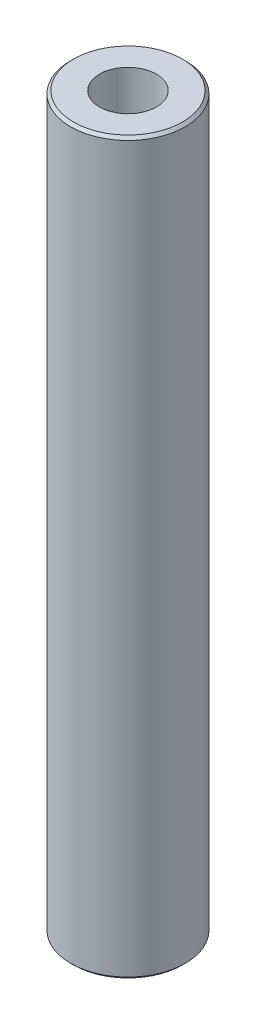
ISO-10303-21;
HEADER;
FILE_DESCRIPTION(('STEP AP214'),'2;1');
FILE_NAME('part.step','',(''),(''),'','','');
FILE_SCHEMA(('AUTOMOTIVE_DESIGN { 1 0 10303 214 1 1 1 1 }'));
ENDSEC;
DATA;
#1=APPLICATION_CONTEXT('core data for automotive mechanical design processes');
#2=APPLICATION_PROTOCOL_DEFINITION('international standard','automotive_design',2000,#1);
#3=PRODUCT_CONTEXT('',#1,'mechanical');
#4=PRODUCT('Part','Part','',(#3));
#5=PRODUCT_RELATED_PRODUCT_CATEGORY('part','',(#4));
#6=PRODUCT_DEFINITION_FORMATION('','',#4);
#7=PRODUCT_DEFINITION_CONTEXT('part definition',#1,'design');
#8=PRODUCT_DEFINITION('design','',#6,#7);
#9=PRODUCT_DEFINITION_SHAPE('','',#8);
#10=(LENGTH_UNIT() NAMED_UNIT(*) SI_UNIT(.MILLI.,.METRE.));
#11=(NAMED_UNIT(*) PLANE_ANGLE_UNIT() SI_UNIT($,.RADIAN.));
#12=(NAMED_UNIT(*) SI_UNIT($,.STERADIAN.) SOLID_ANGLE_UNIT());
#13=UNCERTAINTY_MEASURE_WITH_UNIT(LENGTH_MEASURE(1.E-05),#10,'distance_accuracy_value','');
#14=(GEOMETRIC_REPRESENTATION_CONTEXT(3) GLOBAL_UNCERTAINTY_ASSIGNED_CONTEXT((#13)) GLOBAL_UNIT_ASSIGNED_CONTEXT((#10,
#11,#12)) REPRESENTATION_CONTEXT('',''));
#15=CARTESIAN_POINT('',(0.,0.,0.));
#16=DIRECTION('',(0.,0.,1.));
#17=DIRECTION('',(1.,0.,0.));
#18=AXIS2_PLACEMENT_3D('',#15,#16,#17);
#19=CARTESIAN_POINT('',(0.,254.747592864953,0.));
#20=DIRECTION('',(0.,-1.,0.));
#21=DIRECTION('',(0.,0.,-1.));
#22=AXIS2_PLACEMENT_3D('',#19,#20,#21);
#23=CYLINDRICAL_SURFACE('',#22,20.);
#24=CARTESIAN_POINT('',(0.,253.783528136005,0.));
#25=DIRECTION('',(0.,1.,0.));
#26=DIRECTION('',(0.,0.,1.));
#27=AXIS2_PLACEMENT_3D('',#24,#25,#26);
#28=CIRCLE('',#27,20.);
#29=CARTESIAN_POINT('',(0.,253.783528136005,20.));
#30=VERTEX_POINT('',#29);
#31=EDGE_CURVE('E50',#30,#30,#28,.F.);
#32=ORIENTED_EDGE('',*,*,#31,.T.);
#33=EDGE_LOOP('',(#32));
#34=FACE_BOUND('',#33,.T.);
#35=CARTESIAN_POINT('',(0.,0.964064728948,0.));
#36=DIRECTION('',(0.,1.,0.));
#37=DIRECTION('',(0.,0.,1.));
#38=AXIS2_PLACEMENT_3D('',#35,#36,#37);
#39=CIRCLE('',#38,20.);
#40=CARTESIAN_POINT('',(0.,0.964064728948,20.));
#41=VERTEX_POINT('',#40);
#42=EDGE_CURVE('E51',#41,#41,#39,.T.);
#43=ORIENTED_EDGE('',*,*,#42,.T.);
#44=EDGE_LOOP('',(#43));
#45=FACE_BOUND('',#44,.T.);
#46=ADVANCED_FACE('F39',(#34,#45),#23,.T.);
#47=CARTESIAN_POINT('',(0.,254.747592864953,0.));
#48=DIRECTION('',(0.,1.,0.));
#49=DIRECTION('',(0.,0.,1.));
#50=AXIS2_PLACEMENT_3D('',#47,#48,#49);
#51=PLANE('',#50);
#52=CARTESIAN_POINT('',(0.,254.747592864953,0.));
#53=DIRECTION('',(0.,1.,0.));
#54=DIRECTION('',(0.,0.,1.));
#55=AXIS2_PLACEMENT_3D('',#52,#53,#54);
#56=CIRCLE('',#55,19.035935271052);
#57=CARTESIAN_POINT('',(0.,254.747592864953,19.035935271052));
#58=VERTEX_POINT('',#57);
#59=EDGE_CURVE('E54',#58,#58,#56,.T.);
#60=ORIENTED_EDGE('',*,*,#59,.T.);
#61=EDGE_LOOP('',(#60));
#62=FACE_BOUND('',#61,.T.);
#63=CARTESIAN_POINT('',(0.,254.747592864953,0.));
#64=DIRECTION('',(0.,1.,0.));
#65=DIRECTION('',(0.,0.,1.));
#66=AXIS2_PLACEMENT_3D('',#63,#64,#65);
#67=CIRCLE('',#66,9.9379019761206);
#68=CARTESIAN_POINT('',(0.,254.747592864953,9.9379019761206));
#69=VERTEX_POINT('',#68);
#70=EDGE_CURVE('E58',#69,#69,#67,.T.);
#71=ORIENTED_EDGE('',*,*,#70,.F.);
#72=EDGE_LOOP('',(#71));
#73=FACE_BOUND('',#72,.T.);
#74=ADVANCED_FACE('F69',(#62,#73),#51,.T.);
#75=CARTESIAN_POINT('',(0.,0.,0.));
#76=DIRECTION('',(0.,1.,0.));
#77=DIRECTION('',(0.,0.,1.));
#78=AXIS2_PLACEMENT_3D('',#75,#76,#77);
#79=PLANE('',#78);
#80=CARTESIAN_POINT('',(0.,0.,0.));
#81=DIRECTION('',(0.,1.,0.));
#82=DIRECTION('',(0.,0.,1.));
#83=AXIS2_PLACEMENT_3D('',#80,#81,#82);
#84=CIRCLE('',#83,19.035935271052);
#85=CARTESIAN_POINT('',(0.,0.,19.035935271052));
#86=VERTEX_POINT('',#85);
#87=EDGE_CURVE('E10',#86,#86,#84,.F.);
#88=ORIENTED_EDGE('',*,*,#87,.T.);
#89=EDGE_LOOP('',(#88));
#90=FACE_BOUND('',#89,.T.);
#91=CARTESIAN_POINT('',(0.,0.,0.));
#92=DIRECTION('',(0.,1.,0.));
#93=DIRECTION('',(0.,0.,1.));
#94=AXIS2_PLACEMENT_3D('',#91,#92,#93);
#95=CIRCLE('',#94,9.9379019761206);
#96=CARTESIAN_POINT('',(0.,0.,9.9379019761206));
#97=VERTEX_POINT('',#96);
#98=EDGE_CURVE('E63',#97,#97,#95,.T.);
#99=ORIENTED_EDGE('',*,*,#98,.T.);
#100=EDGE_LOOP('',(#99));
#101=FACE_BOUND('',#100,.T.);
#102=ADVANCED_FACE('F75',(#90,#101),#79,.F.);
#103=CARTESIAN_POINT('',(0.,254.747592864953,0.));
#104=DIRECTION('',(0.,-1.,0.));
#105=DIRECTION('',(0.,0.,-1.));
#106=AXIS2_PLACEMENT_3D('',#103,#104,#105);
#107=CYLINDRICAL_SURFACE('',#106,9.9379019761206);
#108=ORIENTED_EDGE('',*,*,#70,.T.);
#109=EDGE_LOOP('',(#108));
#110=FACE_BOUND('',#109,.T.);
#111=ORIENTED_EDGE('',*,*,#98,.F.);
#112=EDGE_LOOP('',(#111));
#113=FACE_BOUND('',#112,.T.);
#114=ADVANCED_FACE('F70',(#110,#113),#107,.F.);
#115=CARTESIAN_POINT('',(0.,254.747592864953,0.));
#116=DIRECTION('',(0.,-1.,0.));
#117=DIRECTION('',(0.,0.,-1.));
#118=AXIS2_PLACEMENT_3D('',#115,#116,#117);
#119=CONICAL_SURFACE('',#118,19.035935271052,0.785398163397482);
#120=ORIENTED_EDGE('',*,*,#31,.F.);
#121=EDGE_LOOP('',(#120));
#122=FACE_BOUND('',#121,.T.);
#123=ORIENTED_EDGE('',*,*,#59,.F.);
#124=EDGE_LOOP('',(#123));
#125=FACE_BOUND('',#124,.T.);
#126=ADVANCED_FACE('F81',(#122,#125),#119,.T.);
#127=CARTESIAN_POINT('',(0.,0.964064728948,0.));
#128=DIRECTION('',(0.,1.,0.));
#129=DIRECTION('',(0.,0.,1.));
#130=AXIS2_PLACEMENT_3D('',#127,#128,#129);
#131=CONICAL_SURFACE('',#130,20.,0.785398163397439);
#132=ORIENTED_EDGE('',*,*,#87,.F.);
#133=EDGE_LOOP('',(#132));
#134=FACE_BOUND('',#133,.T.);
#135=ORIENTED_EDGE('',*,*,#42,.F.);
#136=EDGE_LOOP('',(#135));
#137=FACE_BOUND('',#136,.T.);
#138=ADVANCED_FACE('F45',(#134,#137),#131,.T.);
#139=CLOSED_SHELL('',(#46,#74,#102,#114,#126,#138));
#140=MANIFOLD_SOLID_BREP('B2',#139);
#141=ADVANCED_BREP_SHAPE_REPRESENTATION('',(#18,#140),#14);
#142=SHAPE_DEFINITION_REPRESENTATION(#9,#141);
ENDSEC;
END-ISO-10303-21;
